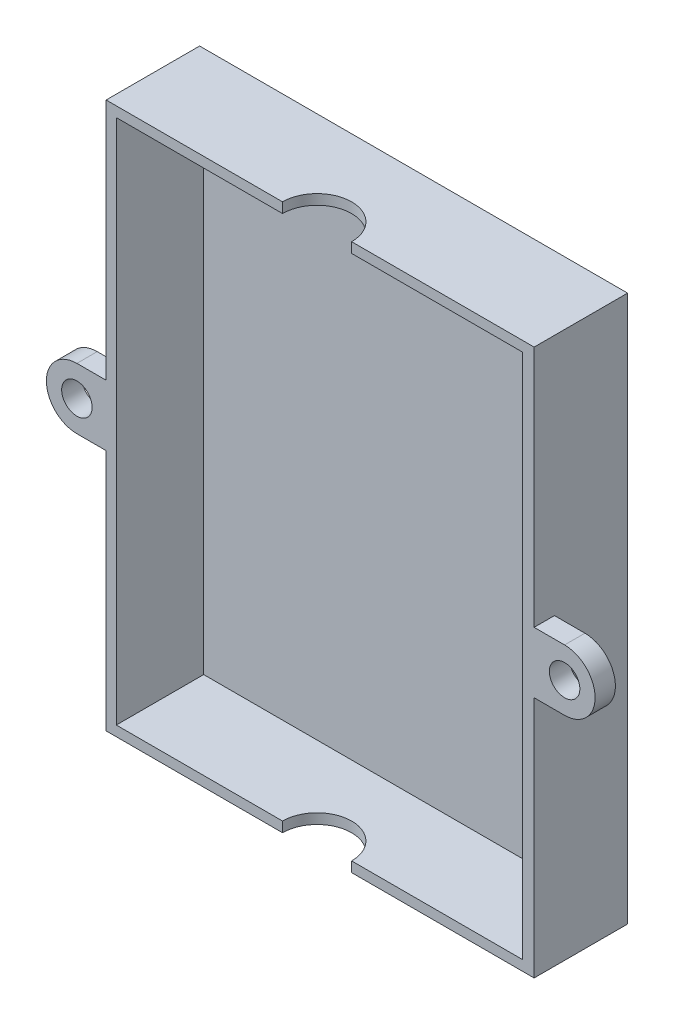
ISO-10303-21;
HEADER;
FILE_DESCRIPTION(('STEP AP214'),'2;1');
FILE_NAME('part.step','',(''),(''),'','','');
FILE_SCHEMA(('AUTOMOTIVE_DESIGN { 1 0 10303 214 1 1 1 1 }'));
ENDSEC;
DATA;
#1=APPLICATION_CONTEXT('core data for automotive mechanical design processes');
#2=APPLICATION_PROTOCOL_DEFINITION('international standard','automotive_design',2000,#1);
#3=PRODUCT_CONTEXT('',#1,'mechanical');
#4=PRODUCT('Part','Part','',(#3));
#5=PRODUCT_RELATED_PRODUCT_CATEGORY('part','',(#4));
#6=PRODUCT_DEFINITION_FORMATION('','',#4);
#7=PRODUCT_DEFINITION_CONTEXT('part definition',#1,'design');
#8=PRODUCT_DEFINITION('design','',#6,#7);
#9=PRODUCT_DEFINITION_SHAPE('','',#8);
#10=(LENGTH_UNIT() NAMED_UNIT(*) SI_UNIT(.MILLI.,.METRE.));
#11=(NAMED_UNIT(*) PLANE_ANGLE_UNIT() SI_UNIT($,.RADIAN.));
#12=(NAMED_UNIT(*) SI_UNIT($,.STERADIAN.) SOLID_ANGLE_UNIT());
#13=UNCERTAINTY_MEASURE_WITH_UNIT(LENGTH_MEASURE(1.E-05),#10,'distance_accuracy_value','');
#14=(GEOMETRIC_REPRESENTATION_CONTEXT(3) GLOBAL_UNCERTAINTY_ASSIGNED_CONTEXT((#13)) GLOBAL_UNIT_ASSIGNED_CONTEXT((#10,
#11,#12)) REPRESENTATION_CONTEXT('',''));
#15=CARTESIAN_POINT('',(0.,0.,0.));
#16=DIRECTION('',(0.,0.,1.));
#17=DIRECTION('',(1.,0.,0.));
#18=AXIS2_PLACEMENT_3D('',#15,#16,#17);
#19=CARTESIAN_POINT('',(0.,0.,46.));
#20=DIRECTION('',(0.,0.,-1.));
#21=DIRECTION('',(-1.,0.,0.));
#22=AXIS2_PLACEMENT_3D('',#19,#20,#21);
#23=PLANE('',#22);
#24=DIRECTION('',(-1.,0.,0.));
#25=VECTOR('',#24,1.);
#26=CARTESIAN_POINT('',(-98.3509164168411,127.735057131812,46.));
#27=LINE('',#26,#25);
#28=CARTESIAN_POINT('',(107.252666614034,127.735057131812,46.));
#29=VERTEX_POINT('',#28);
#30=CARTESIAN_POINT('',(17.4526666140336,127.735057131812,46.));
#31=VERTEX_POINT('',#30);
#32=EDGE_CURVE('E266',#29,#31,#27,.T.);
#33=ORIENTED_EDGE('',*,*,#32,.T.);
#34=DIRECTION('',(0.,-1.,0.));
#35=VECTOR('',#34,1.);
#36=CARTESIAN_POINT('',(17.4526666140336,127.735057131812,46.));
#37=LINE('',#36,#35);
#38=CARTESIAN_POINT('',(17.4526666140336,122.735057131812,46.));
#39=VERTEX_POINT('',#38);
#40=EDGE_CURVE('E43',#31,#39,#37,.T.);
#41=ORIENTED_EDGE('',*,*,#40,.T.);
#42=DIRECTION('',(-1.,0.,0.));
#43=VECTOR('',#42,1.);
#44=CARTESIAN_POINT('',(-98.3509164168411,122.735057131812,46.));
#45=LINE('',#44,#43);
#46=CARTESIAN_POINT('',(101.649083583159,122.735057131812,46.));
#47=VERTEX_POINT('',#46);
#48=EDGE_CURVE('E262',#47,#39,#45,.T.);
#49=ORIENTED_EDGE('',*,*,#48,.F.);
#50=DIRECTION('',(0.,1.,0.));
#51=VECTOR('',#50,1.);
#52=CARTESIAN_POINT('',(101.649083583159,122.735057131812,46.));
#53=LINE('',#52,#51);
#54=CARTESIAN_POINT('',(101.649083583159,-136.14453762788,46.));
#55=VERTEX_POINT('',#54);
#56=EDGE_CURVE('E258',#55,#47,#53,.T.);
#57=ORIENTED_EDGE('',*,*,#56,.F.);
#58=DIRECTION('',(1.,0.,0.));
#59=VECTOR('',#58,1.);
#60=CARTESIAN_POINT('',(101.649083583159,-136.14453762788,46.));
#61=LINE('',#60,#59);
#62=CARTESIAN_POINT('',(17.4526666140336,-136.14453762788,46.));
#63=VERTEX_POINT('',#62);
#64=EDGE_CURVE('E254',#63,#55,#61,.T.);
#65=ORIENTED_EDGE('',*,*,#64,.F.);
#66=CARTESIAN_POINT('',(17.4526666140336,-141.14453762788,46.));
#67=VERTEX_POINT('',#66);
#68=EDGE_CURVE('E328',#63,#67,#37,.T.);
#69=ORIENTED_EDGE('',*,*,#68,.T.);
#70=DIRECTION('',(1.,0.,0.));
#71=VECTOR('',#70,1.);
#72=CARTESIAN_POINT('',(107.252666614034,-141.14453762788,46.));
#73=LINE('',#72,#71);
#74=CARTESIAN_POINT('',(107.252666614034,-141.14453762788,46.));
#75=VERTEX_POINT('',#74);
#76=EDGE_CURVE('E273',#67,#75,#73,.T.);
#77=ORIENTED_EDGE('',*,*,#76,.T.);
#78=DIRECTION('',(0.,1.,0.));
#79=VECTOR('',#78,1.);
#80=CARTESIAN_POINT('',(107.252666614034,127.735057131812,46.));
#81=LINE('',#80,#79);
#82=CARTESIAN_POINT('',(107.252666614034,-21.7047402480343,46.));
#83=VERTEX_POINT('',#82);
#84=EDGE_CURVE('E278',#75,#83,#81,.T.);
#85=ORIENTED_EDGE('',*,*,#84,.T.);
#86=DIRECTION('',(1.,0.,0.));
#87=VECTOR('',#86,1.);
#88=CARTESIAN_POINT('',(122.252666614034,-21.7047402480343,46.));
#89=LINE('',#88,#87);
#90=CARTESIAN_POINT('',(122.252666614034,-21.7047402480343,46.));
#91=VERTEX_POINT('',#90);
#92=EDGE_CURVE('E58',#83,#91,#89,.T.);
#93=ORIENTED_EDGE('',*,*,#92,.T.);
#94=CARTESIAN_POINT('',(122.252666614034,-6.70474024803429,46.));
#95=DIRECTION('',(0.,0.,1.));
#96=DIRECTION('',(1.,0.,0.));
#97=AXIS2_PLACEMENT_3D('',#94,#95,#96);
#98=CIRCLE('',#97,15.);
#99=CARTESIAN_POINT('',(122.252666614034,8.29525975196571,46.));
#100=VERTEX_POINT('',#99);
#101=EDGE_CURVE('E228',#91,#100,#98,.T.);
#102=ORIENTED_EDGE('',*,*,#101,.T.);
#103=DIRECTION('',(-1.,0.,0.));
#104=VECTOR('',#103,1.);
#105=CARTESIAN_POINT('',(122.252666614034,8.29525975196571,46.));
#106=LINE('',#105,#104);
#107=CARTESIAN_POINT('',(107.252666614034,8.29525975196571,46.));
#108=VERTEX_POINT('',#107);
#109=EDGE_CURVE('E217',#100,#108,#106,.T.);
#110=ORIENTED_EDGE('',*,*,#109,.T.);
#111=EDGE_CURVE('E277',#108,#29,#81,.T.);
#112=ORIENTED_EDGE('',*,*,#111,.T.);
#113=EDGE_LOOP('',(#33,#41,#49,#57,#65,#69,#77,#85,#93,#102,#110,#112));
#114=FACE_BOUND('',#113,.T.);
#115=CARTESIAN_POINT('',(122.252666614034,-6.70474024803429,46.));
#116=DIRECTION('',(0.,0.,1.));
#117=DIRECTION('',(1.,0.,0.));
#118=AXIS2_PLACEMENT_3D('',#115,#116,#117);
#119=CIRCLE('',#118,7.5);
#120=CARTESIAN_POINT('',(129.752666614034,-6.70474024803429,46.));
#121=VERTEX_POINT('',#120);
#122=EDGE_CURVE('E207',#121,#121,#119,.T.);
#123=ORIENTED_EDGE('',*,*,#122,.F.);
#124=EDGE_LOOP('',(#123));
#125=FACE_BOUND('',#124,.T.);
#126=ADVANCED_FACE('F35',(#114,#125),#23,.F.);
#127=CARTESIAN_POINT('',(0.,0.,3.));
#128=DIRECTION('',(0.,0.,-1.));
#129=DIRECTION('',(-1.,0.,0.));
#130=AXIS2_PLACEMENT_3D('',#127,#128,#129);
#131=PLANE('',#130);
#132=DIRECTION('',(0.,1.,0.));
#133=VECTOR('',#132,1.);
#134=CARTESIAN_POINT('',(101.649083583159,-136.14453762788,3.));
#135=LINE('',#134,#133);
#136=CARTESIAN_POINT('',(101.649083583159,-136.14453762788,3.));
#137=VERTEX_POINT('',#136);
#138=CARTESIAN_POINT('',(101.649083583159,122.735057131812,3.));
#139=VERTEX_POINT('',#138);
#140=EDGE_CURVE('E305',#137,#139,#135,.T.);
#141=ORIENTED_EDGE('',*,*,#140,.T.);
#142=DIRECTION('',(-1.,0.,0.));
#143=VECTOR('',#142,1.);
#144=CARTESIAN_POINT('',(-98.3509164168411,122.735057131812,3.));
#145=LINE('',#144,#143);
#146=CARTESIAN_POINT('',(-98.3509164168411,122.735057131812,3.));
#147=VERTEX_POINT('',#146);
#148=EDGE_CURVE('E316',#139,#147,#145,.T.);
#149=ORIENTED_EDGE('',*,*,#148,.T.);
#150=DIRECTION('',(0.,-1.,0.));
#151=VECTOR('',#150,1.);
#152=CARTESIAN_POINT('',(-98.3509164168411,-136.14453762788,3.));
#153=LINE('',#152,#151);
#154=CARTESIAN_POINT('',(-98.3509164168411,-136.14453762788,3.));
#155=VERTEX_POINT('',#154);
#156=EDGE_CURVE('E319',#147,#155,#153,.T.);
#157=ORIENTED_EDGE('',*,*,#156,.T.);
#158=DIRECTION('',(1.,0.,0.));
#159=VECTOR('',#158,1.);
#160=CARTESIAN_POINT('',(-98.3509164168411,-136.14453762788,3.));
#161=LINE('',#160,#159);
#162=EDGE_CURVE('E322',#155,#137,#161,.T.);
#163=ORIENTED_EDGE('',*,*,#162,.T.);
#164=EDGE_LOOP('',(#141,#149,#157,#163));
#165=FACE_BOUND('',#164,.T.);
#166=ADVANCED_FACE('F394',(#165),#131,.F.);
#167=CARTESIAN_POINT('',(-98.3509164168411,-136.14453762788,0.));
#168=DIRECTION('',(-1.,0.,0.));
#169=DIRECTION('',(0.,0.,1.));
#170=AXIS2_PLACEMENT_3D('',#167,#168,#169);
#171=PLANE('',#170);
#172=DIRECTION('',(0.,0.,1.));
#173=VECTOR('',#172,1.);
#174=CARTESIAN_POINT('',(-98.3509164168411,-136.14453762788,0.));
#175=LINE('',#174,#173);
#176=CARTESIAN_POINT('',(-98.3509164168411,-136.14453762788,46.));
#177=VERTEX_POINT('',#176);
#178=EDGE_CURVE('E281',#155,#177,#175,.T.);
#179=ORIENTED_EDGE('',*,*,#178,.F.);
#180=ORIENTED_EDGE('',*,*,#156,.F.);
#181=DIRECTION('',(0.,0.,1.));
#182=VECTOR('',#181,1.);
#183=CARTESIAN_POINT('',(-98.3509164168411,122.735057131812,0.));
#184=LINE('',#183,#182);
#185=CARTESIAN_POINT('',(-98.3509164168411,122.735057131812,46.));
#186=VERTEX_POINT('',#185);
#187=EDGE_CURVE('E282',#147,#186,#184,.T.);
#188=ORIENTED_EDGE('',*,*,#187,.T.);
#189=DIRECTION('',(0.,-1.,0.));
#190=VECTOR('',#189,1.);
#191=CARTESIAN_POINT('',(-98.3509164168411,-136.14453762788,46.));
#192=LINE('',#191,#190);
#193=EDGE_CURVE('E251',#186,#177,#192,.T.);
#194=ORIENTED_EDGE('',*,*,#193,.T.);
#195=EDGE_LOOP('',(#179,#180,#188,#194));
#196=FACE_BOUND('',#195,.T.);
#197=ADVANCED_FACE('F346',(#196),#171,.F.);
#198=CARTESIAN_POINT('',(-98.3509164168411,122.735057131812,0.));
#199=DIRECTION('',(0.,1.,0.));
#200=DIRECTION('',(-1.,0.,0.));
#201=AXIS2_PLACEMENT_3D('',#198,#199,#200);
#202=PLANE('',#201);
#203=ORIENTED_EDGE('',*,*,#48,.T.);
#204=CARTESIAN_POINT('',(0.452666614033634,122.735057131812,46.));
#205=DIRECTION('',(0.,1.,0.));
#206=DIRECTION('',(-1.,0.,0.));
#207=AXIS2_PLACEMENT_3D('',#204,#205,#206);
#208=CIRCLE('',#207,17.);
#209=CARTESIAN_POINT('',(-16.5473333859664,122.735057131812,46.));
#210=VERTEX_POINT('',#209);
#211=EDGE_CURVE('E243',#39,#210,#208,.T.);
#212=ORIENTED_EDGE('',*,*,#211,.T.);
#213=EDGE_CURVE('E261',#210,#186,#45,.T.);
#214=ORIENTED_EDGE('',*,*,#213,.T.);
#215=ORIENTED_EDGE('',*,*,#187,.F.);
#216=ORIENTED_EDGE('',*,*,#148,.F.);
#217=DIRECTION('',(0.,0.,1.));
#218=VECTOR('',#217,1.);
#219=CARTESIAN_POINT('',(101.649083583159,122.735057131812,0.));
#220=LINE('',#219,#218);
#221=EDGE_CURVE('E286',#139,#47,#220,.T.);
#222=ORIENTED_EDGE('',*,*,#221,.T.);
#223=EDGE_LOOP('',(#203,#212,#214,#215,#216,#222));
#224=FACE_BOUND('',#223,.T.);
#225=ADVANCED_FACE('F351',(#224),#202,.F.);
#226=CARTESIAN_POINT('',(101.649083583159,122.735057131812,0.));
#227=DIRECTION('',(1.,0.,0.));
#228=DIRECTION('',(0.,1.,0.));
#229=AXIS2_PLACEMENT_3D('',#226,#227,#228);
#230=PLANE('',#229);
#231=ORIENTED_EDGE('',*,*,#221,.F.);
#232=ORIENTED_EDGE('',*,*,#140,.F.);
#233=DIRECTION('',(0.,0.,1.));
#234=VECTOR('',#233,1.);
#235=CARTESIAN_POINT('',(101.649083583159,-136.14453762788,0.));
#236=LINE('',#235,#234);
#237=EDGE_CURVE('E288',#137,#55,#236,.T.);
#238=ORIENTED_EDGE('',*,*,#237,.T.);
#239=ORIENTED_EDGE('',*,*,#56,.T.);
#240=EDGE_LOOP('',(#231,#232,#238,#239));
#241=FACE_BOUND('',#240,.T.);
#242=ADVANCED_FACE('F416',(#241),#230,.F.);
#243=CARTESIAN_POINT('',(101.649083583159,-136.14453762788,0.));
#244=DIRECTION('',(0.,-1.,0.));
#245=DIRECTION('',(0.,0.,-1.));
#246=AXIS2_PLACEMENT_3D('',#243,#244,#245);
#247=PLANE('',#246);
#248=CARTESIAN_POINT('',(-16.5473333859664,-136.14453762788,46.));
#249=VERTEX_POINT('',#248);
#250=EDGE_CURVE('E255',#177,#249,#61,.T.);
#251=ORIENTED_EDGE('',*,*,#250,.T.);
#252=CARTESIAN_POINT('',(0.452666614033634,-136.14453762788,46.));
#253=DIRECTION('',(0.,-1.,0.));
#254=DIRECTION('',(0.,0.,-1.));
#255=AXIS2_PLACEMENT_3D('',#252,#253,#254);
#256=CIRCLE('',#255,17.);
#257=EDGE_CURVE('E248',#249,#63,#256,.T.);
#258=ORIENTED_EDGE('',*,*,#257,.T.);
#259=ORIENTED_EDGE('',*,*,#64,.T.);
#260=ORIENTED_EDGE('',*,*,#237,.F.);
#261=ORIENTED_EDGE('',*,*,#162,.F.);
#262=ORIENTED_EDGE('',*,*,#178,.T.);
#263=EDGE_LOOP('',(#251,#258,#259,#260,#261,#262));
#264=FACE_BOUND('',#263,.T.);
#265=ADVANCED_FACE('F343',(#264),#247,.F.);
#266=CARTESIAN_POINT('',(107.252666614034,127.735057131812,0.));
#267=DIRECTION('',(1.,0.,0.));
#268=DIRECTION('',(0.,0.,-1.));
#269=AXIS2_PLACEMENT_3D('',#266,#267,#268);
#270=PLANE('',#269);
#271=DIRECTION('',(0.,0.,1.));
#272=VECTOR('',#271,1.);
#273=CARTESIAN_POINT('',(107.252666614034,8.29525975196571,36.));
#274=LINE('',#273,#272);
#275=CARTESIAN_POINT('',(107.252666614034,8.29525975196571,36.));
#276=VERTEX_POINT('',#275);
#277=EDGE_CURVE('E233',#276,#108,#274,.T.);
#278=ORIENTED_EDGE('',*,*,#277,.F.);
#279=DIRECTION('',(0.,-1.,0.));
#280=VECTOR('',#279,1.);
#281=CARTESIAN_POINT('',(107.252666614034,-21.7047402480343,36.));
#282=LINE('',#281,#280);
#283=CARTESIAN_POINT('',(107.252666614034,-21.7047402480343,36.));
#284=VERTEX_POINT('',#283);
#285=EDGE_CURVE('E213',#276,#284,#282,.T.);
#286=ORIENTED_EDGE('',*,*,#285,.T.);
#287=DIRECTION('',(0.,0.,1.));
#288=VECTOR('',#287,1.);
#289=CARTESIAN_POINT('',(107.252666614034,-21.7047402480343,36.));
#290=LINE('',#289,#288);
#291=EDGE_CURVE('E226',#284,#83,#290,.T.);
#292=ORIENTED_EDGE('',*,*,#291,.T.);
#293=ORIENTED_EDGE('',*,*,#84,.F.);
#294=DIRECTION('',(0.,0.,1.));
#295=VECTOR('',#294,1.);
#296=CARTESIAN_POINT('',(107.252666614034,-141.14453762788,0.));
#297=LINE('',#296,#295);
#298=CARTESIAN_POINT('',(107.252666614034,-141.14453762788,0.));
#299=VERTEX_POINT('',#298);
#300=EDGE_CURVE('E306',#299,#75,#297,.T.);
#301=ORIENTED_EDGE('',*,*,#300,.F.);
#302=DIRECTION('',(0.,1.,0.));
#303=VECTOR('',#302,1.);
#304=CARTESIAN_POINT('',(107.252666614034,127.735057131812,0.));
#305=LINE('',#304,#303);
#306=CARTESIAN_POINT('',(107.252666614034,127.735057131812,0.));
#307=VERTEX_POINT('',#306);
#308=EDGE_CURVE('E298',#299,#307,#305,.T.);
#309=ORIENTED_EDGE('',*,*,#308,.T.);
#310=DIRECTION('',(0.,0.,1.));
#311=VECTOR('',#310,1.);
#312=CARTESIAN_POINT('',(107.252666614034,127.735057131812,0.));
#313=LINE('',#312,#311);
#314=EDGE_CURVE('E302',#307,#29,#313,.T.);
#315=ORIENTED_EDGE('',*,*,#314,.T.);
#316=ORIENTED_EDGE('',*,*,#111,.F.);
#317=EDGE_LOOP('',(#278,#286,#292,#293,#301,#309,#315,#316));
#318=FACE_BOUND('',#317,.T.);
#319=ADVANCED_FACE('F409',(#318),#270,.T.);
#320=CARTESIAN_POINT('',(107.252666614034,-141.14453762788,0.));
#321=DIRECTION('',(0.,-1.,0.));
#322=DIRECTION('',(0.,0.,-1.));
#323=AXIS2_PLACEMENT_3D('',#320,#321,#322);
#324=PLANE('',#323);
#325=CARTESIAN_POINT('',(0.452666614033634,-141.14453762788,46.));
#326=DIRECTION('',(0.,-1.,0.));
#327=DIRECTION('',(0.,0.,-1.));
#328=AXIS2_PLACEMENT_3D('',#325,#326,#327);
#329=CIRCLE('',#328,17.);
#330=CARTESIAN_POINT('',(-16.5473333859664,-141.14453762788,46.));
#331=VERTEX_POINT('',#330);
#332=EDGE_CURVE('E246',#331,#67,#329,.T.);
#333=ORIENTED_EDGE('',*,*,#332,.F.);
#334=CARTESIAN_POINT('',(-103.350916416841,-141.14453762788,46.));
#335=VERTEX_POINT('',#334);
#336=EDGE_CURVE('E274',#335,#331,#73,.T.);
#337=ORIENTED_EDGE('',*,*,#336,.F.);
#338=DIRECTION('',(0.,0.,1.));
#339=VECTOR('',#338,1.);
#340=CARTESIAN_POINT('',(-103.350916416841,-141.14453762788,0.));
#341=LINE('',#340,#339);
#342=CARTESIAN_POINT('',(-103.350916416841,-141.14453762788,0.));
#343=VERTEX_POINT('',#342);
#344=EDGE_CURVE('E309',#343,#335,#341,.T.);
#345=ORIENTED_EDGE('',*,*,#344,.F.);
#346=DIRECTION('',(1.,0.,0.));
#347=VECTOR('',#346,1.);
#348=CARTESIAN_POINT('',(107.252666614034,-141.14453762788,0.));
#349=LINE('',#348,#347);
#350=EDGE_CURVE('E295',#343,#299,#349,.T.);
#351=ORIENTED_EDGE('',*,*,#350,.T.);
#352=ORIENTED_EDGE('',*,*,#300,.T.);
#353=ORIENTED_EDGE('',*,*,#76,.F.);
#354=EDGE_LOOP('',(#333,#337,#345,#351,#352,#353));
#355=FACE_BOUND('',#354,.T.);
#356=ADVANCED_FACE('F406',(#355),#324,.T.);
#357=CARTESIAN_POINT('',(-103.350916416841,-141.14453762788,0.));
#358=DIRECTION('',(-1.,0.,0.));
#359=DIRECTION('',(0.,0.,1.));
#360=AXIS2_PLACEMENT_3D('',#357,#358,#359);
#361=PLANE('',#360);
#362=DIRECTION('',(0.,0.,1.));
#363=VECTOR('',#362,1.);
#364=CARTESIAN_POINT('',(-103.350916416841,-21.7047402480343,0.));
#365=LINE('',#364,#363);
#366=CARTESIAN_POINT('',(-103.350916416841,-21.7047402480343,36.));
#367=VERTEX_POINT('',#366);
#368=CARTESIAN_POINT('',(-103.350916416841,-21.7047402480343,46.));
#369=VERTEX_POINT('',#368);
#370=EDGE_CURVE('E205',#367,#369,#365,.T.);
#371=ORIENTED_EDGE('',*,*,#370,.F.);
#372=DIRECTION('',(0.,1.,0.));
#373=VECTOR('',#372,1.);
#374=CARTESIAN_POINT('',(-103.350916416841,-141.14453762788,36.));
#375=LINE('',#374,#373);
#376=CARTESIAN_POINT('',(-103.350916416841,8.29525975196571,36.));
#377=VERTEX_POINT('',#376);
#378=EDGE_CURVE('E11',#367,#377,#375,.T.);
#379=ORIENTED_EDGE('',*,*,#378,.T.);
#380=DIRECTION('',(0.,0.,-1.));
#381=VECTOR('',#380,1.);
#382=CARTESIAN_POINT('',(-103.350916416841,8.29525975196571,0.));
#383=LINE('',#382,#381);
#384=CARTESIAN_POINT('',(-103.350916416841,8.29525975196571,46.));
#385=VERTEX_POINT('',#384);
#386=EDGE_CURVE('E179',#385,#377,#383,.T.);
#387=ORIENTED_EDGE('',*,*,#386,.F.);
#388=DIRECTION('',(0.,-1.,0.));
#389=VECTOR('',#388,1.);
#390=CARTESIAN_POINT('',(-103.350916416841,127.735057131812,46.));
#391=LINE('',#390,#389);
#392=CARTESIAN_POINT('',(-103.350916416841,127.735057131812,46.));
#393=VERTEX_POINT('',#392);
#394=EDGE_CURVE('E270',#393,#385,#391,.T.);
#395=ORIENTED_EDGE('',*,*,#394,.F.);
#396=DIRECTION('',(0.,0.,1.));
#397=VECTOR('',#396,1.);
#398=CARTESIAN_POINT('',(-103.350916416841,127.735057131812,0.));
#399=LINE('',#398,#397);
#400=CARTESIAN_POINT('',(-103.350916416841,127.735057131812,0.));
#401=VERTEX_POINT('',#400);
#402=EDGE_CURVE('E301',#401,#393,#399,.T.);
#403=ORIENTED_EDGE('',*,*,#402,.F.);
#404=DIRECTION('',(0.,-1.,0.));
#405=VECTOR('',#404,1.);
#406=CARTESIAN_POINT('',(-103.350916416841,127.735057131812,0.));
#407=LINE('',#406,#405);
#408=EDGE_CURVE('E293',#401,#343,#407,.T.);
#409=ORIENTED_EDGE('',*,*,#408,.T.);
#410=ORIENTED_EDGE('',*,*,#344,.T.);
#411=EDGE_CURVE('E269',#369,#335,#391,.T.);
#412=ORIENTED_EDGE('',*,*,#411,.F.);
#413=EDGE_LOOP('',(#371,#379,#387,#395,#403,#409,#410,#412));
#414=FACE_BOUND('',#413,.T.);
#415=ADVANCED_FACE('F366',(#414),#361,.T.);
#416=CARTESIAN_POINT('',(-98.3509164168411,127.735057131812,0.));
#417=DIRECTION('',(0.,1.,0.));
#418=DIRECTION('',(0.,0.,1.));
#419=AXIS2_PLACEMENT_3D('',#416,#417,#418);
#420=PLANE('',#419);
#421=CARTESIAN_POINT('',(0.452666614033634,127.735057131812,46.));
#422=DIRECTION('',(0.,-1.,0.));
#423=DIRECTION('',(0.,0.,-1.));
#424=AXIS2_PLACEMENT_3D('',#421,#422,#423);
#425=CIRCLE('',#424,17.);
#426=CARTESIAN_POINT('',(-16.5473333859664,127.735057131812,46.));
#427=VERTEX_POINT('',#426);
#428=EDGE_CURVE('E235',#427,#31,#425,.T.);
#429=ORIENTED_EDGE('',*,*,#428,.T.);
#430=ORIENTED_EDGE('',*,*,#32,.F.);
#431=ORIENTED_EDGE('',*,*,#314,.F.);
#432=DIRECTION('',(-1.,0.,0.));
#433=VECTOR('',#432,1.);
#434=CARTESIAN_POINT('',(-98.3509164168411,127.735057131812,0.));
#435=LINE('',#434,#433);
#436=EDGE_CURVE('E285',#307,#401,#435,.T.);
#437=ORIENTED_EDGE('',*,*,#436,.T.);
#438=ORIENTED_EDGE('',*,*,#402,.T.);
#439=EDGE_CURVE('E265',#427,#393,#27,.T.);
#440=ORIENTED_EDGE('',*,*,#439,.F.);
#441=EDGE_LOOP('',(#429,#430,#431,#437,#438,#440));
#442=FACE_BOUND('',#441,.T.);
#443=ADVANCED_FACE('F360',(#442),#420,.T.);
#444=ORIENTED_EDGE('',*,*,#394,.T.);
#445=DIRECTION('',(-1.,0.,0.));
#446=VECTOR('',#445,1.);
#447=CARTESIAN_POINT('',(-117.747333385966,8.29525975196571,46.));
#448=LINE('',#447,#446);
#449=CARTESIAN_POINT('',(-117.747333385966,8.29525975196571,46.));
#450=VERTEX_POINT('',#449);
#451=EDGE_CURVE('E199',#385,#450,#448,.T.);
#452=ORIENTED_EDGE('',*,*,#451,.T.);
#453=CARTESIAN_POINT('',(-117.747333385966,-6.70474024803429,46.));
#454=DIRECTION('',(0.,0.,1.));
#455=DIRECTION('',(1.,0.,0.));
#456=AXIS2_PLACEMENT_3D('',#453,#454,#455);
#457=CIRCLE('',#456,15.);
#458=CARTESIAN_POINT('',(-117.747333385966,-21.7047402480343,46.));
#459=VERTEX_POINT('',#458);
#460=EDGE_CURVE('E188',#450,#459,#457,.T.);
#461=ORIENTED_EDGE('',*,*,#460,.T.);
#462=DIRECTION('',(1.,0.,0.));
#463=VECTOR('',#462,1.);
#464=CARTESIAN_POINT('',(-117.747333385966,-21.7047402480343,46.));
#465=LINE('',#464,#463);
#466=EDGE_CURVE('E50',#459,#369,#465,.T.);
#467=ORIENTED_EDGE('',*,*,#466,.T.);
#468=ORIENTED_EDGE('',*,*,#411,.T.);
#469=ORIENTED_EDGE('',*,*,#336,.T.);
#470=DIRECTION('',(0.,-1.,0.));
#471=VECTOR('',#470,1.);
#472=CARTESIAN_POINT('',(-16.5473333859664,127.735057131812,46.));
#473=LINE('',#472,#471);
#474=EDGE_CURVE('E327',#331,#249,#473,.F.);
#475=ORIENTED_EDGE('',*,*,#474,.T.);
#476=ORIENTED_EDGE('',*,*,#250,.F.);
#477=ORIENTED_EDGE('',*,*,#193,.F.);
#478=ORIENTED_EDGE('',*,*,#213,.F.);
#479=EDGE_CURVE('E325',#210,#427,#473,.F.);
#480=ORIENTED_EDGE('',*,*,#479,.T.);
#481=ORIENTED_EDGE('',*,*,#439,.T.);
#482=EDGE_LOOP('',(#444,#452,#461,#467,#468,#469,#475,#476,#477,#478,#480,#481));
#483=FACE_BOUND('',#482,.T.);
#484=CARTESIAN_POINT('',(-117.747333385966,-6.70474024803429,46.));
#485=DIRECTION('',(0.,0.,1.));
#486=DIRECTION('',(1.,0.,0.));
#487=AXIS2_PLACEMENT_3D('',#484,#485,#486);
#488=CIRCLE('',#487,7.50000000000001);
#489=CARTESIAN_POINT('',(-110.247333385966,-6.70474024803429,46.));
#490=VERTEX_POINT('',#489);
#491=EDGE_CURVE('E372',#490,#490,#488,.T.);
#492=ORIENTED_EDGE('',*,*,#491,.F.);
#493=EDGE_LOOP('',(#492));
#494=FACE_BOUND('',#493,.T.);
#495=ADVANCED_FACE('F336',(#483,#494),#23,.F.);
#496=CARTESIAN_POINT('',(0.,0.,0.));
#497=DIRECTION('',(0.,0.,-1.));
#498=DIRECTION('',(-1.,0.,0.));
#499=AXIS2_PLACEMENT_3D('',#496,#497,#498);
#500=PLANE('',#499);
#501=ORIENTED_EDGE('',*,*,#436,.F.);
#502=ORIENTED_EDGE('',*,*,#308,.F.);
#503=ORIENTED_EDGE('',*,*,#350,.F.);
#504=ORIENTED_EDGE('',*,*,#408,.F.);
#505=EDGE_LOOP('',(#501,#502,#503,#504));
#506=FACE_BOUND('',#505,.T.);
#507=ADVANCED_FACE('F37',(#506),#500,.T.);
#508=CARTESIAN_POINT('',(0.452666614033634,127.735057131812,46.));
#509=DIRECTION('',(0.,-1.,0.));
#510=DIRECTION('',(0.,0.,-1.));
#511=AXIS2_PLACEMENT_3D('',#508,#509,#510);
#512=CYLINDRICAL_SURFACE('',#511,17.);
#513=ORIENTED_EDGE('',*,*,#428,.F.);
#514=ORIENTED_EDGE('',*,*,#479,.F.);
#515=ORIENTED_EDGE('',*,*,#211,.F.);
#516=ORIENTED_EDGE('',*,*,#40,.F.);
#517=EDGE_LOOP('',(#513,#514,#515,#516));
#518=FACE_BOUND('',#517,.T.);
#519=ADVANCED_FACE('F354',(#518),#512,.F.);
#520=ORIENTED_EDGE('',*,*,#257,.F.);
#521=ORIENTED_EDGE('',*,*,#474,.F.);
#522=ORIENTED_EDGE('',*,*,#332,.T.);
#523=ORIENTED_EDGE('',*,*,#68,.F.);
#524=EDGE_LOOP('',(#520,#521,#522,#523));
#525=FACE_BOUND('',#524,.T.);
#526=ADVANCED_FACE('F460',(#525),#512,.F.);
#527=CARTESIAN_POINT('',(122.252666614034,8.29525975196571,36.));
#528=DIRECTION('',(0.,1.,0.));
#529=DIRECTION('',(0.,0.,1.));
#530=AXIS2_PLACEMENT_3D('',#527,#528,#529);
#531=PLANE('',#530);
#532=ORIENTED_EDGE('',*,*,#109,.F.);
#533=DIRECTION('',(0.,0.,1.));
#534=VECTOR('',#533,1.);
#535=CARTESIAN_POINT('',(122.252666614034,8.29525975196571,36.));
#536=LINE('',#535,#534);
#537=CARTESIAN_POINT('',(122.252666614034,8.29525975196571,36.));
#538=VERTEX_POINT('',#537);
#539=EDGE_CURVE('E236',#538,#100,#536,.T.);
#540=ORIENTED_EDGE('',*,*,#539,.F.);
#541=DIRECTION('',(-1.,0.,0.));
#542=VECTOR('',#541,1.);
#543=CARTESIAN_POINT('',(122.252666614034,8.29525975196571,36.));
#544=LINE('',#543,#542);
#545=EDGE_CURVE('E223',#538,#276,#544,.T.);
#546=ORIENTED_EDGE('',*,*,#545,.T.);
#547=ORIENTED_EDGE('',*,*,#277,.T.);
#548=EDGE_LOOP('',(#532,#540,#546,#547));
#549=FACE_BOUND('',#548,.T.);
#550=ADVANCED_FACE('F468',(#549),#531,.T.);
#551=CARTESIAN_POINT('',(122.252666614034,-6.70474024803429,36.));
#552=DIRECTION('',(0.,0.,1.));
#553=DIRECTION('',(1.,0.,0.));
#554=AXIS2_PLACEMENT_3D('',#551,#552,#553);
#555=CYLINDRICAL_SURFACE('',#554,15.);
#556=ORIENTED_EDGE('',*,*,#101,.F.);
#557=DIRECTION('',(0.,0.,1.));
#558=VECTOR('',#557,1.);
#559=CARTESIAN_POINT('',(122.252666614034,-21.7047402480343,36.));
#560=LINE('',#559,#558);
#561=CARTESIAN_POINT('',(122.252666614034,-21.7047402480343,36.));
#562=VERTEX_POINT('',#561);
#563=EDGE_CURVE('E238',#562,#91,#560,.T.);
#564=ORIENTED_EDGE('',*,*,#563,.F.);
#565=CARTESIAN_POINT('',(122.252666614034,-6.70474024803429,36.));
#566=DIRECTION('',(0.,0.,1.));
#567=DIRECTION('',(1.,0.,0.));
#568=AXIS2_PLACEMENT_3D('',#565,#566,#567);
#569=CIRCLE('',#568,15.);
#570=EDGE_CURVE('E220',#562,#538,#569,.T.);
#571=ORIENTED_EDGE('',*,*,#570,.T.);
#572=ORIENTED_EDGE('',*,*,#539,.T.);
#573=EDGE_LOOP('',(#556,#564,#571,#572));
#574=FACE_BOUND('',#573,.T.);
#575=ADVANCED_FACE('F491',(#574),#555,.T.);
#576=CARTESIAN_POINT('',(122.252666614034,-21.7047402480343,36.));
#577=DIRECTION('',(0.,-1.,0.));
#578=DIRECTION('',(0.,0.,-1.));
#579=AXIS2_PLACEMENT_3D('',#576,#577,#578);
#580=PLANE('',#579);
#581=ORIENTED_EDGE('',*,*,#92,.F.);
#582=ORIENTED_EDGE('',*,*,#291,.F.);
#583=DIRECTION('',(1.,0.,0.));
#584=VECTOR('',#583,1.);
#585=CARTESIAN_POINT('',(122.252666614034,-21.7047402480343,36.));
#586=LINE('',#585,#584);
#587=EDGE_CURVE('E216',#284,#562,#586,.T.);
#588=ORIENTED_EDGE('',*,*,#587,.T.);
#589=ORIENTED_EDGE('',*,*,#563,.T.);
#590=EDGE_LOOP('',(#581,#582,#588,#589));
#591=FACE_BOUND('',#590,.T.);
#592=ADVANCED_FACE('F500',(#591),#580,.T.);
#593=CARTESIAN_POINT('',(122.252666614034,-6.70474024803429,36.));
#594=DIRECTION('',(0.,0.,1.));
#595=DIRECTION('',(1.,0.,0.));
#596=AXIS2_PLACEMENT_3D('',#593,#594,#595);
#597=PLANE('',#596);
#598=CARTESIAN_POINT('',(122.252666614034,-6.70474024803429,36.));
#599=DIRECTION('',(0.,0.,1.));
#600=DIRECTION('',(1.,0.,0.));
#601=AXIS2_PLACEMENT_3D('',#598,#599,#600);
#602=CIRCLE('',#601,7.5);
#603=CARTESIAN_POINT('',(129.752666614034,-6.70474024803429,36.));
#604=VERTEX_POINT('',#603);
#605=EDGE_CURVE('E208',#604,#604,#602,.T.);
#606=ORIENTED_EDGE('',*,*,#605,.T.);
#607=EDGE_LOOP('',(#606));
#608=FACE_BOUND('',#607,.T.);
#609=ORIENTED_EDGE('',*,*,#285,.F.);
#610=ORIENTED_EDGE('',*,*,#545,.F.);
#611=ORIENTED_EDGE('',*,*,#570,.F.);
#612=ORIENTED_EDGE('',*,*,#587,.F.);
#613=EDGE_LOOP('',(#609,#610,#611,#612));
#614=FACE_BOUND('',#613,.T.);
#615=ADVANCED_FACE('F509',(#608,#614),#597,.F.);
#616=CARTESIAN_POINT('',(122.252666614034,-6.70474024803429,36.));
#617=DIRECTION('',(0.,0.,1.));
#618=DIRECTION('',(1.,0.,0.));
#619=AXIS2_PLACEMENT_3D('',#616,#617,#618);
#620=CYLINDRICAL_SURFACE('',#619,7.5);
#621=ORIENTED_EDGE('',*,*,#605,.F.);
#622=EDGE_LOOP('',(#621));
#623=FACE_BOUND('',#622,.T.);
#624=ORIENTED_EDGE('',*,*,#122,.T.);
#625=EDGE_LOOP('',(#624));
#626=FACE_BOUND('',#625,.T.);
#627=ADVANCED_FACE('F517',(#623,#626),#620,.F.);
#628=CARTESIAN_POINT('',(-117.747333385966,-21.7047402480343,36.));
#629=DIRECTION('',(0.,-1.,0.));
#630=DIRECTION('',(0.,0.,-1.));
#631=AXIS2_PLACEMENT_3D('',#628,#629,#630);
#632=PLANE('',#631);
#633=DIRECTION('',(1.,0.,0.));
#634=VECTOR('',#633,1.);
#635=CARTESIAN_POINT('',(-117.747333385966,-21.7047402480343,36.));
#636=LINE('',#635,#634);
#637=CARTESIAN_POINT('',(-117.747333385966,-21.7047402480343,36.));
#638=VERTEX_POINT('',#637);
#639=EDGE_CURVE('E183',#638,#367,#636,.T.);
#640=ORIENTED_EDGE('',*,*,#639,.T.);
#641=ORIENTED_EDGE('',*,*,#370,.T.);
#642=ORIENTED_EDGE('',*,*,#466,.F.);
#643=DIRECTION('',(0.,0.,1.));
#644=VECTOR('',#643,1.);
#645=CARTESIAN_POINT('',(-117.747333385966,-21.7047402480343,36.));
#646=LINE('',#645,#644);
#647=EDGE_CURVE('E189',#638,#459,#646,.T.);
#648=ORIENTED_EDGE('',*,*,#647,.F.);
#649=EDGE_LOOP('',(#640,#641,#642,#648));
#650=FACE_BOUND('',#649,.T.);
#651=ADVANCED_FACE('F370',(#650),#632,.T.);
#652=CARTESIAN_POINT('',(-117.747333385966,-6.70474024803429,36.));
#653=DIRECTION('',(0.,0.,1.));
#654=DIRECTION('',(1.,0.,0.));
#655=AXIS2_PLACEMENT_3D('',#652,#653,#654);
#656=CYLINDRICAL_SURFACE('',#655,15.);
#657=ORIENTED_EDGE('',*,*,#460,.F.);
#658=DIRECTION('',(0.,0.,1.));
#659=VECTOR('',#658,1.);
#660=CARTESIAN_POINT('',(-117.747333385966,8.29525975196571,36.));
#661=LINE('',#660,#659);
#662=CARTESIAN_POINT('',(-117.747333385966,8.29525975196571,36.));
#663=VERTEX_POINT('',#662);
#664=EDGE_CURVE('E176',#663,#450,#661,.T.);
#665=ORIENTED_EDGE('',*,*,#664,.F.);
#666=CARTESIAN_POINT('',(-117.747333385966,-6.70474024803429,36.));
#667=DIRECTION('',(0.,0.,1.));
#668=DIRECTION('',(1.,0.,0.));
#669=AXIS2_PLACEMENT_3D('',#666,#667,#668);
#670=CIRCLE('',#669,15.);
#671=EDGE_CURVE('E182',#663,#638,#670,.T.);
#672=ORIENTED_EDGE('',*,*,#671,.T.);
#673=ORIENTED_EDGE('',*,*,#647,.T.);
#674=EDGE_LOOP('',(#657,#665,#672,#673));
#675=FACE_BOUND('',#674,.T.);
#676=ADVANCED_FACE('F187',(#675),#656,.T.);
#677=CARTESIAN_POINT('',(-117.747333385966,8.29525975196571,36.));
#678=DIRECTION('',(0.,1.,0.));
#679=DIRECTION('',(0.,0.,1.));
#680=AXIS2_PLACEMENT_3D('',#677,#678,#679);
#681=PLANE('',#680);
#682=ORIENTED_EDGE('',*,*,#451,.F.);
#683=ORIENTED_EDGE('',*,*,#386,.T.);
#684=DIRECTION('',(-1.,0.,0.));
#685=VECTOR('',#684,1.);
#686=CARTESIAN_POINT('',(-117.747333385966,8.29525975196571,36.));
#687=LINE('',#686,#685);
#688=EDGE_CURVE('E173',#377,#663,#687,.T.);
#689=ORIENTED_EDGE('',*,*,#688,.T.);
#690=ORIENTED_EDGE('',*,*,#664,.T.);
#691=EDGE_LOOP('',(#682,#683,#689,#690));
#692=FACE_BOUND('',#691,.T.);
#693=ADVANCED_FACE('F175',(#692),#681,.T.);
#694=CARTESIAN_POINT('',(-117.747333385966,-6.70474024803429,36.));
#695=DIRECTION('',(0.,0.,1.));
#696=DIRECTION('',(1.,0.,0.));
#697=AXIS2_PLACEMENT_3D('',#694,#695,#696);
#698=PLANE('',#697);
#699=ORIENTED_EDGE('',*,*,#378,.F.);
#700=ORIENTED_EDGE('',*,*,#639,.F.);
#701=ORIENTED_EDGE('',*,*,#671,.F.);
#702=ORIENTED_EDGE('',*,*,#688,.F.);
#703=EDGE_LOOP('',(#699,#700,#701,#702));
#704=FACE_BOUND('',#703,.T.);
#705=CARTESIAN_POINT('',(-117.747333385966,-6.70474024803429,36.));
#706=DIRECTION('',(0.,0.,1.));
#707=DIRECTION('',(1.,0.,0.));
#708=AXIS2_PLACEMENT_3D('',#705,#706,#707);
#709=CIRCLE('',#708,7.50000000000001);
#710=CARTESIAN_POINT('',(-110.247333385966,-6.70474024803429,36.));
#711=VERTEX_POINT('',#710);
#712=EDGE_CURVE('E200',#711,#711,#709,.T.);
#713=ORIENTED_EDGE('',*,*,#712,.T.);
#714=EDGE_LOOP('',(#713));
#715=FACE_BOUND('',#714,.T.);
#716=ADVANCED_FACE('F192',(#704,#715),#698,.F.);
#717=CARTESIAN_POINT('',(-117.747333385966,-6.70474024803429,36.));
#718=DIRECTION('',(0.,0.,1.));
#719=DIRECTION('',(1.,0.,0.));
#720=AXIS2_PLACEMENT_3D('',#717,#718,#719);
#721=CYLINDRICAL_SURFACE('',#720,7.50000000000001);
#722=ORIENTED_EDGE('',*,*,#712,.F.);
#723=EDGE_LOOP('',(#722));
#724=FACE_BOUND('',#723,.T.);
#725=ORIENTED_EDGE('',*,*,#491,.T.);
#726=EDGE_LOOP('',(#725));
#727=FACE_BOUND('',#726,.T.);
#728=ADVANCED_FACE('F378',(#724,#727),#721,.F.);
#729=CLOSED_SHELL('',(#126,#166,#197,#225,#242,#265,#319,#356,#415,#443,#495,#507,#519,#526,
#550,#575,#592,#615,#627,#651,#676,#693,#716,#728));
#730=MANIFOLD_SOLID_BREP('B2',#729);
#731=ADVANCED_BREP_SHAPE_REPRESENTATION('',(#18,#730),#14);
#732=SHAPE_DEFINITION_REPRESENTATION(#9,#731);
ENDSEC;
END-ISO-10303-21;
